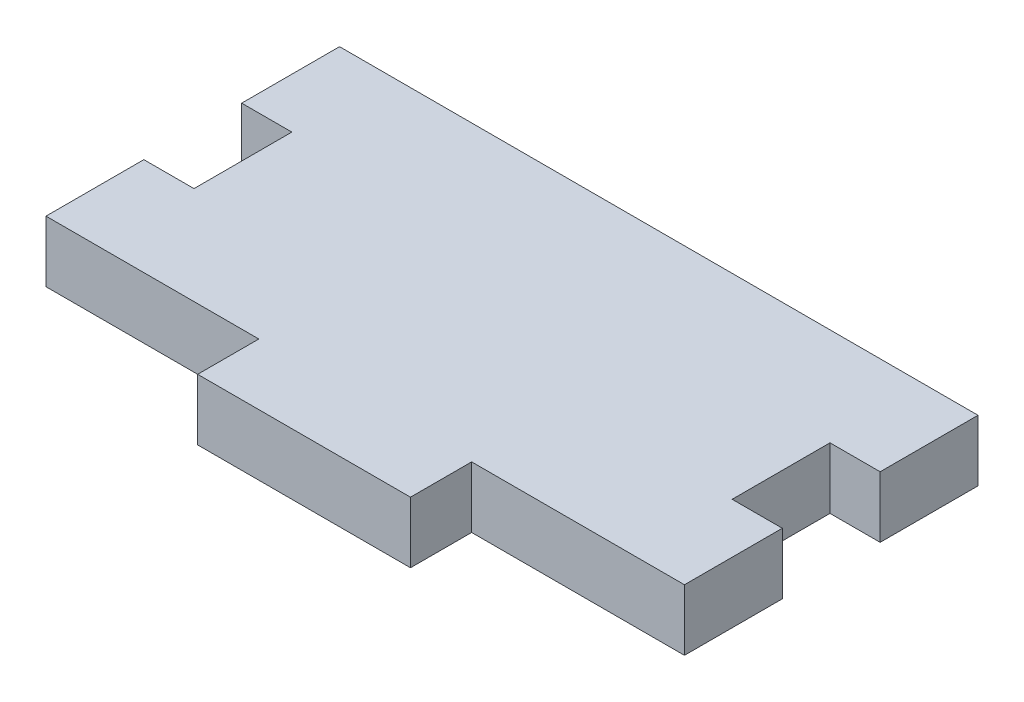
ISO-10303-21;
HEADER;
FILE_DESCRIPTION(('STEP AP214'),'2;1');
FILE_NAME('part.step','',(''),(''),'','','');
FILE_SCHEMA(('AUTOMOTIVE_DESIGN { 1 0 10303 214 1 1 1 1 }'));
ENDSEC;
DATA;
#1=APPLICATION_CONTEXT('core data for automotive mechanical design processes');
#2=APPLICATION_PROTOCOL_DEFINITION('international standard','automotive_design',2000,#1);
#3=PRODUCT_CONTEXT('',#1,'mechanical');
#4=PRODUCT('Part','Part','',(#3));
#5=PRODUCT_RELATED_PRODUCT_CATEGORY('part','',(#4));
#6=PRODUCT_DEFINITION_FORMATION('','',#4);
#7=PRODUCT_DEFINITION_CONTEXT('part definition',#1,'design');
#8=PRODUCT_DEFINITION('design','',#6,#7);
#9=PRODUCT_DEFINITION_SHAPE('','',#8);
#10=(LENGTH_UNIT() NAMED_UNIT(*) SI_UNIT(.MILLI.,.METRE.));
#11=(NAMED_UNIT(*) PLANE_ANGLE_UNIT() SI_UNIT($,.RADIAN.));
#12=(NAMED_UNIT(*) SI_UNIT($,.STERADIAN.) SOLID_ANGLE_UNIT());
#13=UNCERTAINTY_MEASURE_WITH_UNIT(LENGTH_MEASURE(1.E-05),#10,'distance_accuracy_value','');
#14=(GEOMETRIC_REPRESENTATION_CONTEXT(3) GLOBAL_UNCERTAINTY_ASSIGNED_CONTEXT((#13)) GLOBAL_UNIT_ASSIGNED_CONTEXT((#10,
#11,#12)) REPRESENTATION_CONTEXT('',''));
#15=CARTESIAN_POINT('',(0.,0.,0.));
#16=DIRECTION('',(0.,0.,1.));
#17=DIRECTION('',(1.,0.,0.));
#18=AXIS2_PLACEMENT_3D('',#15,#16,#17);
#19=CARTESIAN_POINT('',(-33.147,3.175,15.24));
#20=DIRECTION('',(1.,0.,0.));
#21=DIRECTION('',(0.,0.,-1.));
#22=AXIS2_PLACEMENT_3D('',#19,#20,#21);
#23=PLANE('',#22);
#24=DIRECTION('',(0.,0.,1.));
#25=VECTOR('',#24,1.);
#26=CARTESIAN_POINT('',(-33.147,-3.175,15.24));
#27=LINE('',#26,#25);
#28=CARTESIAN_POINT('',(-33.147,-3.175,-15.24));
#29=VERTEX_POINT('',#28);
#30=CARTESIAN_POINT('',(-33.147,-3.175,-5.08));
#31=VERTEX_POINT('',#30);
#32=EDGE_CURVE('E295',#29,#31,#27,.T.);
#33=ORIENTED_EDGE('',*,*,#32,.T.);
#34=DIRECTION('',(0.,1.,0.));
#35=VECTOR('',#34,1.);
#36=CARTESIAN_POINT('',(-33.147,3.17500000000001,-5.08));
#37=LINE('',#36,#35);
#38=CARTESIAN_POINT('',(-33.147,3.175,-5.08));
#39=VERTEX_POINT('',#38);
#40=EDGE_CURVE('E178',#31,#39,#37,.T.);
#41=ORIENTED_EDGE('',*,*,#40,.T.);
#42=DIRECTION('',(0.,0.,1.));
#43=VECTOR('',#42,1.);
#44=CARTESIAN_POINT('',(-33.147,3.175,15.24));
#45=LINE('',#44,#43);
#46=CARTESIAN_POINT('',(-33.147,3.175,-15.24));
#47=VERTEX_POINT('',#46);
#48=EDGE_CURVE('E165',#47,#39,#45,.T.);
#49=ORIENTED_EDGE('',*,*,#48,.F.);
#50=DIRECTION('',(0.,-1.,0.));
#51=VECTOR('',#50,1.);
#52=CARTESIAN_POINT('',(-33.147,3.175,-15.24));
#53=LINE('',#52,#51);
#54=EDGE_CURVE('E304',#47,#29,#53,.T.);
#55=ORIENTED_EDGE('',*,*,#54,.T.);
#56=EDGE_LOOP('',(#33,#41,#49,#55));
#57=FACE_BOUND('',#56,.T.);
#58=ADVANCED_FACE('F33',(#57),#23,.F.);
#59=CARTESIAN_POINT('',(33.147,3.175,15.24));
#60=DIRECTION('',(-1.,0.,0.));
#61=DIRECTION('',(0.,0.,1.));
#62=AXIS2_PLACEMENT_3D('',#59,#60,#61);
#63=PLANE('',#62);
#64=DIRECTION('',(0.,0.,-1.));
#65=VECTOR('',#64,1.);
#66=CARTESIAN_POINT('',(33.147,3.175,15.24));
#67=LINE('',#66,#65);
#68=CARTESIAN_POINT('',(33.147,3.175,-5.08));
#69=VERTEX_POINT('',#68);
#70=CARTESIAN_POINT('',(33.147,3.175,-15.24));
#71=VERTEX_POINT('',#70);
#72=EDGE_CURVE('E317',#69,#71,#67,.T.);
#73=ORIENTED_EDGE('',*,*,#72,.F.);
#74=DIRECTION('',(0.,-1.,0.));
#75=VECTOR('',#74,1.);
#76=CARTESIAN_POINT('',(33.147,3.17500000000001,-5.08));
#77=LINE('',#76,#75);
#78=CARTESIAN_POINT('',(33.147,-3.175,-5.08));
#79=VERTEX_POINT('',#78);
#80=EDGE_CURVE('E205',#69,#79,#77,.T.);
#81=ORIENTED_EDGE('',*,*,#80,.T.);
#82=DIRECTION('',(0.,0.,-1.));
#83=VECTOR('',#82,1.);
#84=CARTESIAN_POINT('',(33.147,-3.175,15.24));
#85=LINE('',#84,#83);
#86=CARTESIAN_POINT('',(33.147,-3.175,-15.24));
#87=VERTEX_POINT('',#86);
#88=EDGE_CURVE('E227',#79,#87,#85,.T.);
#89=ORIENTED_EDGE('',*,*,#88,.T.);
#90=DIRECTION('',(0.,-1.,0.));
#91=VECTOR('',#90,1.);
#92=CARTESIAN_POINT('',(33.147,3.175,-15.24));
#93=LINE('',#92,#91);
#94=EDGE_CURVE('E248',#71,#87,#93,.T.);
#95=ORIENTED_EDGE('',*,*,#94,.F.);
#96=EDGE_LOOP('',(#73,#81,#89,#95));
#97=FACE_BOUND('',#96,.T.);
#98=ADVANCED_FACE('F316',(#97),#63,.F.);
#99=CARTESIAN_POINT('',(-33.147,3.175,15.24));
#100=DIRECTION('',(0.,0.,-1.));
#101=DIRECTION('',(-1.,0.,0.));
#102=AXIS2_PLACEMENT_3D('',#99,#100,#101);
#103=PLANE('',#102);
#104=DIRECTION('',(0.,1.,0.));
#105=VECTOR('',#104,1.);
#106=CARTESIAN_POINT('',(11.049,-3.175,15.24));
#107=LINE('',#106,#105);
#108=CARTESIAN_POINT('',(11.049,-3.175,15.24));
#109=VERTEX_POINT('',#108);
#110=CARTESIAN_POINT('',(11.049,3.175,15.24));
#111=VERTEX_POINT('',#110);
#112=EDGE_CURVE('E228',#109,#111,#107,.T.);
#113=ORIENTED_EDGE('',*,*,#112,.F.);
#114=DIRECTION('',(1.,0.,0.));
#115=VECTOR('',#114,1.);
#116=CARTESIAN_POINT('',(-33.147,-3.175,15.24));
#117=LINE('',#116,#115);
#118=CARTESIAN_POINT('',(33.147,-3.175,15.24));
#119=VERTEX_POINT('',#118);
#120=EDGE_CURVE('E291',#109,#119,#117,.T.);
#121=ORIENTED_EDGE('',*,*,#120,.T.);
#122=DIRECTION('',(0.,-1.,0.));
#123=VECTOR('',#122,1.);
#124=CARTESIAN_POINT('',(33.147,3.175,15.24));
#125=LINE('',#124,#123);
#126=CARTESIAN_POINT('',(33.147,3.175,15.24));
#127=VERTEX_POINT('',#126);
#128=EDGE_CURVE('E290',#127,#119,#125,.T.);
#129=ORIENTED_EDGE('',*,*,#128,.F.);
#130=DIRECTION('',(1.,0.,0.));
#131=VECTOR('',#130,1.);
#132=CARTESIAN_POINT('',(-33.147,3.175,15.24));
#133=LINE('',#132,#131);
#134=EDGE_CURVE('E276',#111,#127,#133,.T.);
#135=ORIENTED_EDGE('',*,*,#134,.F.);
#136=EDGE_LOOP('',(#113,#121,#129,#135));
#137=FACE_BOUND('',#136,.T.);
#138=ADVANCED_FACE('F356',(#137),#103,.F.);
#139=CARTESIAN_POINT('',(33.147,-3.175,5.08));
#140=VERTEX_POINT('',#139);
#141=EDGE_CURVE('E283',#119,#140,#85,.T.);
#142=ORIENTED_EDGE('',*,*,#141,.T.);
#143=DIRECTION('',(0.,1.,0.));
#144=VECTOR('',#143,1.);
#145=CARTESIAN_POINT('',(33.147,3.175,5.07999999999999));
#146=LINE('',#145,#144);
#147=CARTESIAN_POINT('',(33.147,3.175,5.07999999999999));
#148=VERTEX_POINT('',#147);
#149=EDGE_CURVE('E57',#140,#148,#146,.T.);
#150=ORIENTED_EDGE('',*,*,#149,.T.);
#151=EDGE_CURVE('E277',#127,#148,#67,.T.);
#152=ORIENTED_EDGE('',*,*,#151,.F.);
#153=ORIENTED_EDGE('',*,*,#128,.T.);
#154=EDGE_LOOP('',(#142,#150,#152,#153));
#155=FACE_BOUND('',#154,.T.);
#156=ADVANCED_FACE('F35',(#155),#63,.F.);
#157=CARTESIAN_POINT('',(-33.147,3.175,-15.24));
#158=DIRECTION('',(0.,0.,1.));
#159=DIRECTION('',(1.,0.,0.));
#160=AXIS2_PLACEMENT_3D('',#157,#158,#159);
#161=PLANE('',#160);
#162=DIRECTION('',(-1.,0.,0.));
#163=VECTOR('',#162,1.);
#164=CARTESIAN_POINT('',(-33.147,-3.175,-15.24));
#165=LINE('',#164,#163);
#166=EDGE_CURVE('E313',#87,#29,#165,.T.);
#167=ORIENTED_EDGE('',*,*,#166,.T.);
#168=ORIENTED_EDGE('',*,*,#54,.F.);
#169=DIRECTION('',(-1.,0.,0.));
#170=VECTOR('',#169,1.);
#171=CARTESIAN_POINT('',(-33.147,3.175,-15.24));
#172=LINE('',#171,#170);
#173=EDGE_CURVE('E274',#71,#47,#172,.T.);
#174=ORIENTED_EDGE('',*,*,#173,.F.);
#175=ORIENTED_EDGE('',*,*,#94,.T.);
#176=EDGE_LOOP('',(#167,#168,#174,#175));
#177=FACE_BOUND('',#176,.T.);
#178=ADVANCED_FACE('F310',(#177),#161,.F.);
#179=CARTESIAN_POINT('',(-33.147,3.175,5.07999999999999));
#180=VERTEX_POINT('',#179);
#181=CARTESIAN_POINT('',(-33.147,3.175,15.24));
#182=VERTEX_POINT('',#181);
#183=EDGE_CURVE('E270',#180,#182,#45,.T.);
#184=ORIENTED_EDGE('',*,*,#183,.F.);
#185=DIRECTION('',(0.,-1.,0.));
#186=VECTOR('',#185,1.);
#187=CARTESIAN_POINT('',(-33.147,3.175,5.07999999999999));
#188=LINE('',#187,#186);
#189=CARTESIAN_POINT('',(-33.147,-3.175,5.07999999999999));
#190=VERTEX_POINT('',#189);
#191=EDGE_CURVE('E168',#180,#190,#188,.T.);
#192=ORIENTED_EDGE('',*,*,#191,.T.);
#193=CARTESIAN_POINT('',(-33.147,-3.175,15.24));
#194=VERTEX_POINT('',#193);
#195=EDGE_CURVE('E263',#190,#194,#27,.T.);
#196=ORIENTED_EDGE('',*,*,#195,.T.);
#197=DIRECTION('',(0.,-1.,0.));
#198=VECTOR('',#197,1.);
#199=CARTESIAN_POINT('',(-33.147,3.175,15.24));
#200=LINE('',#199,#198);
#201=EDGE_CURVE('E271',#182,#194,#200,.T.);
#202=ORIENTED_EDGE('',*,*,#201,.F.);
#203=EDGE_LOOP('',(#184,#192,#196,#202));
#204=FACE_BOUND('',#203,.T.);
#205=ADVANCED_FACE('F267',(#204),#23,.F.);
#206=CARTESIAN_POINT('',(-11.049,-3.175,15.24));
#207=VERTEX_POINT('',#206);
#208=EDGE_CURVE('E294',#194,#207,#117,.T.);
#209=ORIENTED_EDGE('',*,*,#208,.T.);
#210=DIRECTION('',(0.,1.,0.));
#211=VECTOR('',#210,1.);
#212=CARTESIAN_POINT('',(-11.049,-3.175,15.24));
#213=LINE('',#212,#211);
#214=CARTESIAN_POINT('',(-11.049,3.175,15.24));
#215=VERTEX_POINT('',#214);
#216=EDGE_CURVE('E223',#207,#215,#213,.T.);
#217=ORIENTED_EDGE('',*,*,#216,.T.);
#218=EDGE_CURVE('E288',#182,#215,#133,.T.);
#219=ORIENTED_EDGE('',*,*,#218,.F.);
#220=ORIENTED_EDGE('',*,*,#201,.T.);
#221=EDGE_LOOP('',(#209,#217,#219,#220));
#222=FACE_BOUND('',#221,.T.);
#223=ADVANCED_FACE('F359',(#222),#103,.F.);
#224=CARTESIAN_POINT('',(33.147,3.175,-15.24));
#225=DIRECTION('',(0.,-1.,0.));
#226=DIRECTION('',(0.,0.,-1.));
#227=AXIS2_PLACEMENT_3D('',#224,#225,#226);
#228=PLANE('',#227);
#229=ORIENTED_EDGE('',*,*,#48,.T.);
#230=DIRECTION('',(1.,0.,0.));
#231=VECTOR('',#230,1.);
#232=CARTESIAN_POINT('',(-34.29,3.175,-5.08));
#233=LINE('',#232,#231);
#234=CARTESIAN_POINT('',(-27.94,3.175,-5.08));
#235=VERTEX_POINT('',#234);
#236=EDGE_CURVE('E158',#39,#235,#233,.T.);
#237=ORIENTED_EDGE('',*,*,#236,.T.);
#238=DIRECTION('',(0.,0.,1.));
#239=VECTOR('',#238,1.);
#240=CARTESIAN_POINT('',(-27.94,3.175,-5.08));
#241=LINE('',#240,#239);
#242=CARTESIAN_POINT('',(-27.94,3.175,5.07999999999999));
#243=VERTEX_POINT('',#242);
#244=EDGE_CURVE('E147',#235,#243,#241,.T.);
#245=ORIENTED_EDGE('',*,*,#244,.T.);
#246=DIRECTION('',(1.,0.,0.));
#247=VECTOR('',#246,1.);
#248=CARTESIAN_POINT('',(-34.29,3.175,5.07999999999999));
#249=LINE('',#248,#247);
#250=EDGE_CURVE('E166',#180,#243,#249,.T.);
#251=ORIENTED_EDGE('',*,*,#250,.F.);
#252=ORIENTED_EDGE('',*,*,#183,.T.);
#253=ORIENTED_EDGE('',*,*,#218,.T.);
#254=DIRECTION('',(0.,0.,1.));
#255=VECTOR('',#254,1.);
#256=CARTESIAN_POINT('',(-11.049,3.175,15.24));
#257=LINE('',#256,#255);
#258=CARTESIAN_POINT('',(-11.049,3.175,21.59));
#259=VERTEX_POINT('',#258);
#260=EDGE_CURVE('E208',#215,#259,#257,.T.);
#261=ORIENTED_EDGE('',*,*,#260,.T.);
#262=DIRECTION('',(1.,0.,0.));
#263=VECTOR('',#262,1.);
#264=CARTESIAN_POINT('',(-11.049,3.175,21.59));
#265=LINE('',#264,#263);
#266=CARTESIAN_POINT('',(11.049,3.175,21.59));
#267=VERTEX_POINT('',#266);
#268=EDGE_CURVE('E214',#259,#267,#265,.T.);
#269=ORIENTED_EDGE('',*,*,#268,.T.);
#270=DIRECTION('',(0.,0.,-1.));
#271=VECTOR('',#270,1.);
#272=CARTESIAN_POINT('',(11.049,3.175,15.24));
#273=LINE('',#272,#271);
#274=EDGE_CURVE('E217',#267,#111,#273,.T.);
#275=ORIENTED_EDGE('',*,*,#274,.T.);
#276=ORIENTED_EDGE('',*,*,#134,.T.);
#277=ORIENTED_EDGE('',*,*,#151,.T.);
#278=DIRECTION('',(1.,0.,0.));
#279=VECTOR('',#278,1.);
#280=CARTESIAN_POINT('',(27.94,3.175,5.07999999999999));
#281=LINE('',#280,#279);
#282=CARTESIAN_POINT('',(27.94,3.175,5.07999999999999));
#283=VERTEX_POINT('',#282);
#284=EDGE_CURVE('E200',#283,#148,#281,.T.);
#285=ORIENTED_EDGE('',*,*,#284,.F.);
#286=DIRECTION('',(0.,0.,1.));
#287=VECTOR('',#286,1.);
#288=CARTESIAN_POINT('',(27.94,3.175,-5.08));
#289=LINE('',#288,#287);
#290=CARTESIAN_POINT('',(27.94,3.175,-5.08));
#291=VERTEX_POINT('',#290);
#292=EDGE_CURVE('E181',#291,#283,#289,.T.);
#293=ORIENTED_EDGE('',*,*,#292,.F.);
#294=DIRECTION('',(1.,0.,0.));
#295=VECTOR('',#294,1.);
#296=CARTESIAN_POINT('',(27.94,3.175,-5.08));
#297=LINE('',#296,#295);
#298=EDGE_CURVE('E194',#291,#69,#297,.T.);
#299=ORIENTED_EDGE('',*,*,#298,.T.);
#300=ORIENTED_EDGE('',*,*,#72,.T.);
#301=ORIENTED_EDGE('',*,*,#173,.T.);
#302=EDGE_LOOP('',(#229,#237,#245,#251,#252,#253,#261,#269,#275,#276,#277,#285,#293,#299,#300,#301));
#303=FACE_BOUND('',#302,.T.);
#304=ADVANCED_FACE('F163',(#303),#228,.F.);
#305=CARTESIAN_POINT('',(33.147,-3.175,-15.24));
#306=DIRECTION('',(0.,-1.,0.));
#307=DIRECTION('',(0.,0.,-1.));
#308=AXIS2_PLACEMENT_3D('',#305,#306,#307);
#309=PLANE('',#308);
#310=ORIENTED_EDGE('',*,*,#32,.F.);
#311=ORIENTED_EDGE('',*,*,#166,.F.);
#312=ORIENTED_EDGE('',*,*,#88,.F.);
#313=DIRECTION('',(1.,0.,0.));
#314=VECTOR('',#313,1.);
#315=CARTESIAN_POINT('',(27.94,-3.175,-5.08));
#316=LINE('',#315,#314);
#317=CARTESIAN_POINT('',(27.94,-3.175,-5.08));
#318=VERTEX_POINT('',#317);
#319=EDGE_CURVE('E190',#318,#79,#316,.T.);
#320=ORIENTED_EDGE('',*,*,#319,.F.);
#321=DIRECTION('',(0.,0.,-1.));
#322=VECTOR('',#321,1.);
#323=CARTESIAN_POINT('',(27.94,-3.175,-15.24));
#324=LINE('',#323,#322);
#325=CARTESIAN_POINT('',(27.94,-3.175,5.07999999999999));
#326=VERTEX_POINT('',#325);
#327=EDGE_CURVE('E245',#326,#318,#324,.T.);
#328=ORIENTED_EDGE('',*,*,#327,.F.);
#329=DIRECTION('',(1.,0.,0.));
#330=VECTOR('',#329,1.);
#331=CARTESIAN_POINT('',(27.94,-3.175,5.07999999999999));
#332=LINE('',#331,#330);
#333=EDGE_CURVE('E193',#326,#140,#332,.T.);
#334=ORIENTED_EDGE('',*,*,#333,.T.);
#335=ORIENTED_EDGE('',*,*,#141,.F.);
#336=ORIENTED_EDGE('',*,*,#120,.F.);
#337=DIRECTION('',(0.,0.,-1.));
#338=VECTOR('',#337,1.);
#339=CARTESIAN_POINT('',(11.049,-3.175,15.24));
#340=LINE('',#339,#338);
#341=CARTESIAN_POINT('',(11.049,-3.175,21.59));
#342=VERTEX_POINT('',#341);
#343=EDGE_CURVE('E212',#342,#109,#340,.T.);
#344=ORIENTED_EDGE('',*,*,#343,.F.);
#345=DIRECTION('',(1.,0.,0.));
#346=VECTOR('',#345,1.);
#347=CARTESIAN_POINT('',(-11.049,-3.175,21.59));
#348=LINE('',#347,#346);
#349=CARTESIAN_POINT('',(-11.049,-3.175,21.59));
#350=VERTEX_POINT('',#349);
#351=EDGE_CURVE('E209',#350,#342,#348,.T.);
#352=ORIENTED_EDGE('',*,*,#351,.F.);
#353=DIRECTION('',(0.,0.,1.));
#354=VECTOR('',#353,1.);
#355=CARTESIAN_POINT('',(-11.049,-3.175,15.24));
#356=LINE('',#355,#354);
#357=EDGE_CURVE('E213',#207,#350,#356,.T.);
#358=ORIENTED_EDGE('',*,*,#357,.F.);
#359=ORIENTED_EDGE('',*,*,#208,.F.);
#360=ORIENTED_EDGE('',*,*,#195,.F.);
#361=DIRECTION('',(-1.,0.,0.));
#362=VECTOR('',#361,1.);
#363=CARTESIAN_POINT('',(33.147,-3.175,5.08));
#364=LINE('',#363,#362);
#365=CARTESIAN_POINT('',(-27.94,-3.175,5.07999999999999));
#366=VERTEX_POINT('',#365);
#367=EDGE_CURVE('E247',#366,#190,#364,.T.);
#368=ORIENTED_EDGE('',*,*,#367,.F.);
#369=DIRECTION('',(0.,0.,-1.));
#370=VECTOR('',#369,1.);
#371=CARTESIAN_POINT('',(-27.94,-3.175,-15.24));
#372=LINE('',#371,#370);
#373=CARTESIAN_POINT('',(-27.94,-3.175,-5.08));
#374=VERTEX_POINT('',#373);
#375=EDGE_CURVE('E42',#366,#374,#372,.T.);
#376=ORIENTED_EDGE('',*,*,#375,.T.);
#377=DIRECTION('',(1.,0.,0.));
#378=VECTOR('',#377,1.);
#379=CARTESIAN_POINT('',(33.147,-3.175,-5.08));
#380=LINE('',#379,#378);
#381=EDGE_CURVE('E11',#31,#374,#380,.T.);
#382=ORIENTED_EDGE('',*,*,#381,.F.);
#383=EDGE_LOOP('',(#310,#311,#312,#320,#328,#334,#335,#336,#344,#352,#358,#359,#360,#368,#376,#382));
#384=FACE_BOUND('',#383,.T.);
#385=ADVANCED_FACE('F259',(#384),#309,.T.);
#386=CARTESIAN_POINT('',(-11.049,-3.175,15.24));
#387=DIRECTION('',(-1.,0.,0.));
#388=DIRECTION('',(0.,0.,1.));
#389=AXIS2_PLACEMENT_3D('',#386,#387,#388);
#390=PLANE('',#389);
#391=ORIENTED_EDGE('',*,*,#260,.F.);
#392=ORIENTED_EDGE('',*,*,#216,.F.);
#393=ORIENTED_EDGE('',*,*,#357,.T.);
#394=DIRECTION('',(0.,1.,0.));
#395=VECTOR('',#394,1.);
#396=CARTESIAN_POINT('',(-11.049,-3.175,21.59));
#397=LINE('',#396,#395);
#398=EDGE_CURVE('E238',#350,#259,#397,.T.);
#399=ORIENTED_EDGE('',*,*,#398,.T.);
#400=EDGE_LOOP('',(#391,#392,#393,#399));
#401=FACE_BOUND('',#400,.T.);
#402=ADVANCED_FACE('F378',(#401),#390,.T.);
#403=CARTESIAN_POINT('',(11.049,-3.175,15.24));
#404=DIRECTION('',(1.,0.,0.));
#405=DIRECTION('',(0.,0.,-1.));
#406=AXIS2_PLACEMENT_3D('',#403,#404,#405);
#407=PLANE('',#406);
#408=ORIENTED_EDGE('',*,*,#274,.F.);
#409=DIRECTION('',(0.,1.,0.));
#410=VECTOR('',#409,1.);
#411=CARTESIAN_POINT('',(11.049,-3.175,21.59));
#412=LINE('',#411,#410);
#413=EDGE_CURVE('E236',#342,#267,#412,.T.);
#414=ORIENTED_EDGE('',*,*,#413,.F.);
#415=ORIENTED_EDGE('',*,*,#343,.T.);
#416=ORIENTED_EDGE('',*,*,#112,.T.);
#417=EDGE_LOOP('',(#408,#414,#415,#416));
#418=FACE_BOUND('',#417,.T.);
#419=ADVANCED_FACE('F346',(#418),#407,.T.);
#420=CARTESIAN_POINT('',(-11.049,-3.175,21.59));
#421=DIRECTION('',(0.,0.,1.));
#422=DIRECTION('',(1.,0.,0.));
#423=AXIS2_PLACEMENT_3D('',#420,#421,#422);
#424=PLANE('',#423);
#425=ORIENTED_EDGE('',*,*,#268,.F.);
#426=ORIENTED_EDGE('',*,*,#398,.F.);
#427=ORIENTED_EDGE('',*,*,#351,.T.);
#428=ORIENTED_EDGE('',*,*,#413,.T.);
#429=EDGE_LOOP('',(#425,#426,#427,#428));
#430=FACE_BOUND('',#429,.T.);
#431=ADVANCED_FACE('F339',(#430),#424,.T.);
#432=CARTESIAN_POINT('',(27.94,-3.175,-5.08));
#433=DIRECTION('',(0.,0.,-1.));
#434=DIRECTION('',(0.,1.,0.));
#435=AXIS2_PLACEMENT_3D('',#432,#433,#434);
#436=PLANE('',#435);
#437=ORIENTED_EDGE('',*,*,#298,.F.);
#438=DIRECTION('',(0.,1.,0.));
#439=VECTOR('',#438,1.);
#440=CARTESIAN_POINT('',(27.94,-3.175,-5.08));
#441=LINE('',#440,#439);
#442=EDGE_CURVE('E180',#318,#291,#441,.T.);
#443=ORIENTED_EDGE('',*,*,#442,.F.);
#444=ORIENTED_EDGE('',*,*,#319,.T.);
#445=ORIENTED_EDGE('',*,*,#80,.F.);
#446=EDGE_LOOP('',(#437,#443,#444,#445));
#447=FACE_BOUND('',#446,.T.);
#448=ADVANCED_FACE('F337',(#447),#436,.F.);
#449=CARTESIAN_POINT('',(27.94,-3.175,5.07999999999999));
#450=DIRECTION('',(0.,0.,1.));
#451=DIRECTION('',(-1.,0.,0.));
#452=AXIS2_PLACEMENT_3D('',#449,#450,#451);
#453=PLANE('',#452);
#454=ORIENTED_EDGE('',*,*,#333,.F.);
#455=DIRECTION('',(0.,-1.,0.));
#456=VECTOR('',#455,1.);
#457=CARTESIAN_POINT('',(27.94,-3.175,5.07999999999999));
#458=LINE('',#457,#456);
#459=EDGE_CURVE('E184',#283,#326,#458,.T.);
#460=ORIENTED_EDGE('',*,*,#459,.F.);
#461=ORIENTED_EDGE('',*,*,#284,.T.);
#462=ORIENTED_EDGE('',*,*,#149,.F.);
#463=EDGE_LOOP('',(#454,#460,#461,#462));
#464=FACE_BOUND('',#463,.T.);
#465=ADVANCED_FACE('F329',(#464),#453,.F.);
#466=CARTESIAN_POINT('',(27.94,-37.719,15.24));
#467=DIRECTION('',(-1.,0.,0.));
#468=DIRECTION('',(0.,0.,-1.));
#469=AXIS2_PLACEMENT_3D('',#466,#467,#468);
#470=PLANE('',#469);
#471=ORIENTED_EDGE('',*,*,#327,.T.);
#472=ORIENTED_EDGE('',*,*,#442,.T.);
#473=ORIENTED_EDGE('',*,*,#292,.T.);
#474=ORIENTED_EDGE('',*,*,#459,.T.);
#475=EDGE_LOOP('',(#471,#472,#473,#474));
#476=FACE_BOUND('',#475,.T.);
#477=ADVANCED_FACE('F333',(#476),#470,.F.);
#478=CARTESIAN_POINT('',(-34.29,-3.175,-5.08));
#479=DIRECTION('',(0.,0.,-1.));
#480=DIRECTION('',(0.,1.,0.));
#481=AXIS2_PLACEMENT_3D('',#478,#479,#480);
#482=PLANE('',#481);
#483=ORIENTED_EDGE('',*,*,#381,.T.);
#484=DIRECTION('',(0.,1.,0.));
#485=VECTOR('',#484,1.);
#486=CARTESIAN_POINT('',(-27.94,-3.175,-5.08));
#487=LINE('',#486,#485);
#488=EDGE_CURVE('E150',#374,#235,#487,.T.);
#489=ORIENTED_EDGE('',*,*,#488,.T.);
#490=ORIENTED_EDGE('',*,*,#236,.F.);
#491=ORIENTED_EDGE('',*,*,#40,.F.);
#492=EDGE_LOOP('',(#483,#489,#490,#491));
#493=FACE_BOUND('',#492,.T.);
#494=ADVANCED_FACE('F157',(#493),#482,.F.);
#495=CARTESIAN_POINT('',(-34.29,-3.175,5.07999999999999));
#496=DIRECTION('',(0.,0.,1.));
#497=DIRECTION('',(-1.,0.,0.));
#498=AXIS2_PLACEMENT_3D('',#495,#496,#497);
#499=PLANE('',#498);
#500=ORIENTED_EDGE('',*,*,#250,.T.);
#501=DIRECTION('',(0.,-1.,0.));
#502=VECTOR('',#501,1.);
#503=CARTESIAN_POINT('',(-27.94,-3.175,5.07999999999999));
#504=LINE('',#503,#502);
#505=EDGE_CURVE('E49',#243,#366,#504,.T.);
#506=ORIENTED_EDGE('',*,*,#505,.T.);
#507=ORIENTED_EDGE('',*,*,#367,.T.);
#508=ORIENTED_EDGE('',*,*,#191,.F.);
#509=EDGE_LOOP('',(#500,#506,#507,#508));
#510=FACE_BOUND('',#509,.T.);
#511=ADVANCED_FACE('F264',(#510),#499,.F.);
#512=CARTESIAN_POINT('',(-27.94,-37.719,15.24));
#513=DIRECTION('',(-1.,0.,0.));
#514=DIRECTION('',(0.,0.,-1.));
#515=AXIS2_PLACEMENT_3D('',#512,#513,#514);
#516=PLANE('',#515);
#517=ORIENTED_EDGE('',*,*,#505,.F.);
#518=ORIENTED_EDGE('',*,*,#244,.F.);
#519=ORIENTED_EDGE('',*,*,#488,.F.);
#520=ORIENTED_EDGE('',*,*,#375,.F.);
#521=EDGE_LOOP('',(#517,#518,#519,#520));
#522=FACE_BOUND('',#521,.T.);
#523=ADVANCED_FACE('F149',(#522),#516,.T.);
#524=CLOSED_SHELL('',(#58,#98,#138,#156,#178,#205,#223,#304,#385,#402,#419,#431,#448,#465,#477,
#494,#511,#523));
#525=MANIFOLD_SOLID_BREP('B2',#524);
#526=ADVANCED_BREP_SHAPE_REPRESENTATION('',(#18,#525),#14);
#527=SHAPE_DEFINITION_REPRESENTATION(#9,#526);
ENDSEC;
END-ISO-10303-21;
